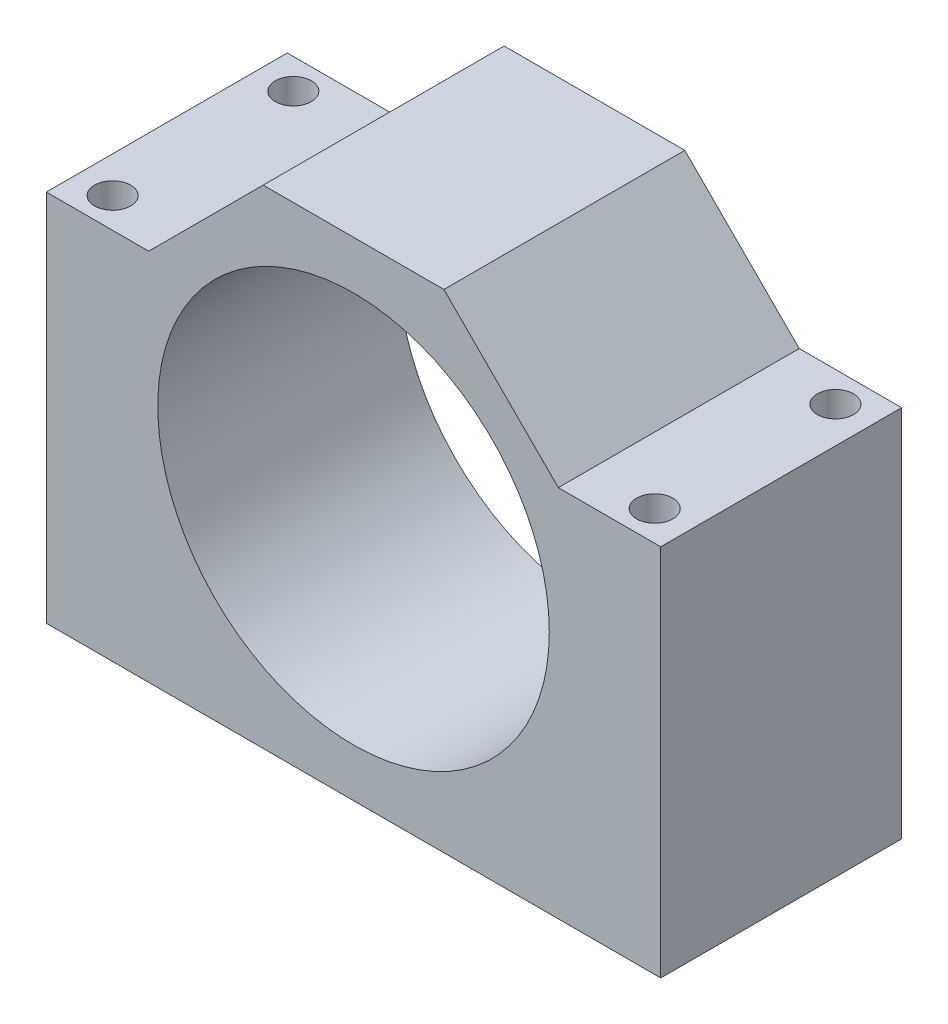
ISO-10303-21;
HEADER;
FILE_DESCRIPTION(('STEP AP214'),'2;1');
FILE_NAME('part.step','',(''),(''),'','','');
FILE_SCHEMA(('AUTOMOTIVE_DESIGN { 1 0 10303 214 1 1 1 1 }'));
ENDSEC;
DATA;
#1=APPLICATION_CONTEXT('core data for automotive mechanical design processes');
#2=APPLICATION_PROTOCOL_DEFINITION('international standard','automotive_design',2000,#1);
#3=PRODUCT_CONTEXT('',#1,'mechanical');
#4=PRODUCT('Part','Part','',(#3));
#5=PRODUCT_RELATED_PRODUCT_CATEGORY('part','',(#4));
#6=PRODUCT_DEFINITION_FORMATION('','',#4);
#7=PRODUCT_DEFINITION_CONTEXT('part definition',#1,'design');
#8=PRODUCT_DEFINITION('design','',#6,#7);
#9=PRODUCT_DEFINITION_SHAPE('','',#8);
#10=(LENGTH_UNIT() NAMED_UNIT(*) SI_UNIT(.MILLI.,.METRE.));
#11=(NAMED_UNIT(*) PLANE_ANGLE_UNIT() SI_UNIT($,.RADIAN.));
#12=(NAMED_UNIT(*) SI_UNIT($,.STERADIAN.) SOLID_ANGLE_UNIT());
#13=UNCERTAINTY_MEASURE_WITH_UNIT(LENGTH_MEASURE(1.E-05),#10,'distance_accuracy_value','');
#14=(GEOMETRIC_REPRESENTATION_CONTEXT(3) GLOBAL_UNCERTAINTY_ASSIGNED_CONTEXT((#13)) GLOBAL_UNIT_ASSIGNED_CONTEXT((#10,
#11,#12)) REPRESENTATION_CONTEXT('',''));
#15=CARTESIAN_POINT('',(0.,0.,0.));
#16=DIRECTION('',(0.,0.,1.));
#17=DIRECTION('',(1.,0.,0.));
#18=AXIS2_PLACEMENT_3D('',#15,#16,#17);
#19=CARTESIAN_POINT('',(0.,0.,40.));
#20=DIRECTION('',(0.,0.,-1.));
#21=DIRECTION('',(-1.,0.,0.));
#22=AXIS2_PLACEMENT_3D('',#19,#20,#21);
#23=PLANE('',#22);
#24=DIRECTION('',(0.,-1.,0.));
#25=VECTOR('',#24,1.);
#26=CARTESIAN_POINT('',(0.,0.,40.));
#27=LINE('',#26,#25);
#28=CARTESIAN_POINT('',(0.,62.,40.));
#29=VERTEX_POINT('',#28);
#30=CARTESIAN_POINT('',(0.,0.,40.));
#31=VERTEX_POINT('',#30);
#32=EDGE_CURVE('E164',#29,#31,#27,.T.);
#33=ORIENTED_EDGE('',*,*,#32,.T.);
#34=DIRECTION('',(1.,0.,0.));
#35=VECTOR('',#34,1.);
#36=CARTESIAN_POINT('',(0.,0.,40.));
#37=LINE('',#36,#35);
#38=CARTESIAN_POINT('',(102.,0.,40.));
#39=VERTEX_POINT('',#38);
#40=EDGE_CURVE('E100',#31,#39,#37,.T.);
#41=ORIENTED_EDGE('',*,*,#40,.T.);
#42=DIRECTION('',(0.,1.,0.));
#43=VECTOR('',#42,1.);
#44=CARTESIAN_POINT('',(102.,0.,40.));
#45=LINE('',#44,#43);
#46=CARTESIAN_POINT('',(102.,62.,40.));
#47=VERTEX_POINT('',#46);
#48=EDGE_CURVE('E185',#39,#47,#45,.T.);
#49=ORIENTED_EDGE('',*,*,#48,.T.);
#50=DIRECTION('',(-1.,0.,0.));
#51=VECTOR('',#50,1.);
#52=CARTESIAN_POINT('',(102.,62.,40.));
#53=LINE('',#52,#51);
#54=CARTESIAN_POINT('',(85.,62.,40.));
#55=VERTEX_POINT('',#54);
#56=EDGE_CURVE('E199',#47,#55,#53,.T.);
#57=ORIENTED_EDGE('',*,*,#56,.T.);
#58=DIRECTION('',(-0.707106781186547,0.707106781186548,0.));
#59=VECTOR('',#58,1.);
#60=CARTESIAN_POINT('',(85.,62.,40.));
#61=LINE('',#60,#59);
#62=CARTESIAN_POINT('',(66.,81.,40.));
#63=VERTEX_POINT('',#62);
#64=EDGE_CURVE('E119',#55,#63,#61,.T.);
#65=ORIENTED_EDGE('',*,*,#64,.T.);
#66=DIRECTION('',(-1.,0.,0.));
#67=VECTOR('',#66,1.);
#68=CARTESIAN_POINT('',(36.,81.,40.));
#69=LINE('',#68,#67);
#70=CARTESIAN_POINT('',(36.,81.,40.));
#71=VERTEX_POINT('',#70);
#72=EDGE_CURVE('E113',#63,#71,#69,.T.);
#73=ORIENTED_EDGE('',*,*,#72,.T.);
#74=DIRECTION('',(-0.707106781186547,-0.707106781186548,0.));
#75=VECTOR('',#74,1.);
#76=CARTESIAN_POINT('',(17.,62.,40.));
#77=LINE('',#76,#75);
#78=CARTESIAN_POINT('',(17.,62.,40.));
#79=VERTEX_POINT('',#78);
#80=EDGE_CURVE('E117',#71,#79,#77,.T.);
#81=ORIENTED_EDGE('',*,*,#80,.T.);
#82=DIRECTION('',(-1.,0.,0.));
#83=VECTOR('',#82,1.);
#84=CARTESIAN_POINT('',(0.,62.,40.));
#85=LINE('',#84,#83);
#86=EDGE_CURVE('E57',#79,#29,#85,.T.);
#87=ORIENTED_EDGE('',*,*,#86,.T.);
#88=EDGE_LOOP('',(#33,#41,#49,#57,#65,#73,#81,#87));
#89=FACE_BOUND('',#88,.T.);
#90=CARTESIAN_POINT('',(51.,40.5,40.));
#91=DIRECTION('',(0.,0.,1.));
#92=DIRECTION('',(1.,0.,0.));
#93=AXIS2_PLACEMENT_3D('',#90,#91,#92);
#94=CIRCLE('',#93,32.5);
#95=CARTESIAN_POINT('',(83.5,40.5,40.));
#96=VERTEX_POINT('',#95);
#97=EDGE_CURVE('E146',#96,#96,#94,.T.);
#98=ORIENTED_EDGE('',*,*,#97,.F.);
#99=EDGE_LOOP('',(#98));
#100=FACE_BOUND('',#99,.T.);
#101=ADVANCED_FACE('F39',(#89,#100),#23,.F.);
#102=CARTESIAN_POINT('',(0.,0.,0.));
#103=DIRECTION('',(0.,0.,-1.));
#104=DIRECTION('',(-1.,0.,0.));
#105=AXIS2_PLACEMENT_3D('',#102,#103,#104);
#106=PLANE('',#105);
#107=DIRECTION('',(0.,-1.,0.));
#108=VECTOR('',#107,1.);
#109=CARTESIAN_POINT('',(0.,0.,0.));
#110=LINE('',#109,#108);
#111=CARTESIAN_POINT('',(0.,62.,0.));
#112=VERTEX_POINT('',#111);
#113=CARTESIAN_POINT('',(0.,0.,0.));
#114=VERTEX_POINT('',#113);
#115=EDGE_CURVE('E141',#112,#114,#110,.T.);
#116=ORIENTED_EDGE('',*,*,#115,.F.);
#117=DIRECTION('',(-1.,0.,0.));
#118=VECTOR('',#117,1.);
#119=CARTESIAN_POINT('',(0.,62.,0.));
#120=LINE('',#119,#118);
#121=CARTESIAN_POINT('',(17.,62.,0.));
#122=VERTEX_POINT('',#121);
#123=EDGE_CURVE('E92',#122,#112,#120,.T.);
#124=ORIENTED_EDGE('',*,*,#123,.F.);
#125=DIRECTION('',(-0.707106781186547,-0.707106781186548,0.));
#126=VECTOR('',#125,1.);
#127=CARTESIAN_POINT('',(17.,62.,0.));
#128=LINE('',#127,#126);
#129=CARTESIAN_POINT('',(36.,81.,0.));
#130=VERTEX_POINT('',#129);
#131=EDGE_CURVE('E86',#130,#122,#128,.T.);
#132=ORIENTED_EDGE('',*,*,#131,.F.);
#133=DIRECTION('',(-1.,0.,0.));
#134=VECTOR('',#133,1.);
#135=CARTESIAN_POINT('',(36.,81.,0.));
#136=LINE('',#135,#134);
#137=CARTESIAN_POINT('',(66.,81.,0.));
#138=VERTEX_POINT('',#137);
#139=EDGE_CURVE('E128',#138,#130,#136,.T.);
#140=ORIENTED_EDGE('',*,*,#139,.F.);
#141=DIRECTION('',(-0.707106781186547,0.707106781186548,0.));
#142=VECTOR('',#141,1.);
#143=CARTESIAN_POINT('',(85.,62.,0.));
#144=LINE('',#143,#142);
#145=CARTESIAN_POINT('',(85.,62.,0.));
#146=VERTEX_POINT('',#145);
#147=EDGE_CURVE('E155',#146,#138,#144,.T.);
#148=ORIENTED_EDGE('',*,*,#147,.F.);
#149=DIRECTION('',(-1.,0.,0.));
#150=VECTOR('',#149,1.);
#151=CARTESIAN_POINT('',(102.,62.,0.));
#152=LINE('',#151,#150);
#153=CARTESIAN_POINT('',(102.,62.,0.));
#154=VERTEX_POINT('',#153);
#155=EDGE_CURVE('E152',#154,#146,#152,.T.);
#156=ORIENTED_EDGE('',*,*,#155,.F.);
#157=DIRECTION('',(0.,1.,0.));
#158=VECTOR('',#157,1.);
#159=CARTESIAN_POINT('',(102.,0.,0.));
#160=LINE('',#159,#158);
#161=CARTESIAN_POINT('',(102.,0.,0.));
#162=VERTEX_POINT('',#161);
#163=EDGE_CURVE('E149',#162,#154,#160,.T.);
#164=ORIENTED_EDGE('',*,*,#163,.F.);
#165=DIRECTION('',(1.,0.,0.));
#166=VECTOR('',#165,1.);
#167=CARTESIAN_POINT('',(0.,0.,0.));
#168=LINE('',#167,#166);
#169=EDGE_CURVE('E145',#114,#162,#168,.T.);
#170=ORIENTED_EDGE('',*,*,#169,.F.);
#171=EDGE_LOOP('',(#116,#124,#132,#140,#148,#156,#164,#170));
#172=FACE_BOUND('',#171,.T.);
#173=CARTESIAN_POINT('',(51.,40.5,0.));
#174=DIRECTION('',(0.,0.,1.));
#175=DIRECTION('',(1.,0.,0.));
#176=AXIS2_PLACEMENT_3D('',#173,#174,#175);
#177=CIRCLE('',#176,32.5);
#178=CARTESIAN_POINT('',(83.5,40.5,0.));
#179=VERTEX_POINT('',#178);
#180=EDGE_CURVE('E209',#179,#179,#177,.T.);
#181=ORIENTED_EDGE('',*,*,#180,.T.);
#182=EDGE_LOOP('',(#181));
#183=FACE_BOUND('',#182,.T.);
#184=ADVANCED_FACE('F189',(#172,#183),#106,.T.);
#185=CARTESIAN_POINT('',(0.,0.,40.));
#186=DIRECTION('',(1.,0.,0.));
#187=DIRECTION('',(0.,0.,-1.));
#188=AXIS2_PLACEMENT_3D('',#185,#186,#187);
#189=PLANE('',#188);
#190=ORIENTED_EDGE('',*,*,#115,.T.);
#191=DIRECTION('',(0.,0.,-1.));
#192=VECTOR('',#191,1.);
#193=CARTESIAN_POINT('',(0.,0.,40.));
#194=LINE('',#193,#192);
#195=EDGE_CURVE('E11',#31,#114,#194,.T.);
#196=ORIENTED_EDGE('',*,*,#195,.F.);
#197=ORIENTED_EDGE('',*,*,#32,.F.);
#198=DIRECTION('',(0.,0.,-1.));
#199=VECTOR('',#198,1.);
#200=CARTESIAN_POINT('',(0.,62.,40.));
#201=LINE('',#200,#199);
#202=EDGE_CURVE('E137',#29,#112,#201,.T.);
#203=ORIENTED_EDGE('',*,*,#202,.T.);
#204=EDGE_LOOP('',(#190,#196,#197,#203));
#205=FACE_BOUND('',#204,.T.);
#206=ADVANCED_FACE('F41',(#205),#189,.F.);
#207=CARTESIAN_POINT('',(0.,0.,40.));
#208=DIRECTION('',(0.,1.,0.));
#209=DIRECTION('',(-1.,0.,0.));
#210=AXIS2_PLACEMENT_3D('',#207,#208,#209);
#211=PLANE('',#210);
#212=CARTESIAN_POINT('',(5.99999999999998,0.,35.));
#213=DIRECTION('',(0.,1.,0.));
#214=DIRECTION('',(0.,0.,1.));
#215=AXIS2_PLACEMENT_3D('',#212,#213,#214);
#216=CIRCLE('',#215,3.);
#217=CARTESIAN_POINT('',(5.99999999999998,0.,38.));
#218=VERTEX_POINT('',#217);
#219=EDGE_CURVE('E221',#218,#218,#216,.T.);
#220=ORIENTED_EDGE('',*,*,#219,.T.);
#221=EDGE_LOOP('',(#220));
#222=FACE_BOUND('',#221,.T.);
#223=CARTESIAN_POINT('',(96.,0.,4.99999999999999));
#224=DIRECTION('',(0.,1.,0.));
#225=DIRECTION('',(0.,0.,1.));
#226=AXIS2_PLACEMENT_3D('',#223,#224,#225);
#227=CIRCLE('',#226,3.00000000000001);
#228=CARTESIAN_POINT('',(96.,0.,8.));
#229=VERTEX_POINT('',#228);
#230=EDGE_CURVE('E229',#229,#229,#227,.T.);
#231=ORIENTED_EDGE('',*,*,#230,.T.);
#232=EDGE_LOOP('',(#231));
#233=FACE_BOUND('',#232,.T.);
#234=CARTESIAN_POINT('',(96.,0.,35.));
#235=DIRECTION('',(0.,1.,0.));
#236=DIRECTION('',(0.,0.,1.));
#237=AXIS2_PLACEMENT_3D('',#234,#235,#236);
#238=CIRCLE('',#237,3.00000000000001);
#239=CARTESIAN_POINT('',(96.,0.,38.));
#240=VERTEX_POINT('',#239);
#241=EDGE_CURVE('E230',#240,#240,#238,.T.);
#242=ORIENTED_EDGE('',*,*,#241,.T.);
#243=EDGE_LOOP('',(#242));
#244=FACE_BOUND('',#243,.T.);
#245=CARTESIAN_POINT('',(5.99999999999998,0.,5.));
#246=DIRECTION('',(0.,1.,0.));
#247=DIRECTION('',(0.,0.,1.));
#248=AXIS2_PLACEMENT_3D('',#245,#246,#247);
#249=CIRCLE('',#248,3.);
#250=CARTESIAN_POINT('',(5.99999999999998,0.,8.00000000000001));
#251=VERTEX_POINT('',#250);
#252=EDGE_CURVE('E213',#251,#251,#249,.T.);
#253=ORIENTED_EDGE('',*,*,#252,.T.);
#254=EDGE_LOOP('',(#253));
#255=FACE_BOUND('',#254,.T.);
#256=ORIENTED_EDGE('',*,*,#169,.T.);
#257=DIRECTION('',(0.,0.,-1.));
#258=VECTOR('',#257,1.);
#259=CARTESIAN_POINT('',(102.,0.,40.));
#260=LINE('',#259,#258);
#261=EDGE_CURVE('E49',#39,#162,#260,.T.);
#262=ORIENTED_EDGE('',*,*,#261,.F.);
#263=ORIENTED_EDGE('',*,*,#40,.F.);
#264=ORIENTED_EDGE('',*,*,#195,.T.);
#265=EDGE_LOOP('',(#256,#262,#263,#264));
#266=FACE_BOUND('',#265,.T.);
#267=ADVANCED_FACE('F249',(#222,#233,#244,#255,#266),#211,.F.);
#268=CARTESIAN_POINT('',(102.,0.,40.));
#269=DIRECTION('',(-1.,0.,0.));
#270=DIRECTION('',(0.,-1.,0.));
#271=AXIS2_PLACEMENT_3D('',#268,#269,#270);
#272=PLANE('',#271);
#273=ORIENTED_EDGE('',*,*,#163,.T.);
#274=DIRECTION('',(0.,0.,-1.));
#275=VECTOR('',#274,1.);
#276=CARTESIAN_POINT('',(102.,62.,40.));
#277=LINE('',#276,#275);
#278=EDGE_CURVE('E175',#47,#154,#277,.T.);
#279=ORIENTED_EDGE('',*,*,#278,.F.);
#280=ORIENTED_EDGE('',*,*,#48,.F.);
#281=ORIENTED_EDGE('',*,*,#261,.T.);
#282=EDGE_LOOP('',(#273,#279,#280,#281));
#283=FACE_BOUND('',#282,.T.);
#284=ADVANCED_FACE('F183',(#283),#272,.F.);
#285=CARTESIAN_POINT('',(102.,62.,40.));
#286=DIRECTION('',(0.,-1.,0.));
#287=DIRECTION('',(0.,0.,-1.));
#288=AXIS2_PLACEMENT_3D('',#285,#286,#287);
#289=PLANE('',#288);
#290=CARTESIAN_POINT('',(96.,62.,4.99999999999999));
#291=DIRECTION('',(0.,1.,0.));
#292=DIRECTION('',(0.,0.,1.));
#293=AXIS2_PLACEMENT_3D('',#290,#291,#292);
#294=CIRCLE('',#293,3.00000000000001);
#295=CARTESIAN_POINT('',(96.,62.,8.));
#296=VERTEX_POINT('',#295);
#297=EDGE_CURVE('E225',#296,#296,#294,.T.);
#298=ORIENTED_EDGE('',*,*,#297,.F.);
#299=EDGE_LOOP('',(#298));
#300=FACE_BOUND('',#299,.T.);
#301=CARTESIAN_POINT('',(96.,62.,35.));
#302=DIRECTION('',(0.,1.,0.));
#303=DIRECTION('',(0.,0.,1.));
#304=AXIS2_PLACEMENT_3D('',#301,#302,#303);
#305=CIRCLE('',#304,3.00000000000001);
#306=CARTESIAN_POINT('',(96.,62.,38.));
#307=VERTEX_POINT('',#306);
#308=EDGE_CURVE('E241',#307,#307,#305,.T.);
#309=ORIENTED_EDGE('',*,*,#308,.F.);
#310=EDGE_LOOP('',(#309));
#311=FACE_BOUND('',#310,.T.);
#312=ORIENTED_EDGE('',*,*,#155,.T.);
#313=DIRECTION('',(0.,0.,-1.));
#314=VECTOR('',#313,1.);
#315=CARTESIAN_POINT('',(85.,62.,40.));
#316=LINE('',#315,#314);
#317=EDGE_CURVE('E171',#55,#146,#316,.T.);
#318=ORIENTED_EDGE('',*,*,#317,.F.);
#319=ORIENTED_EDGE('',*,*,#56,.F.);
#320=ORIENTED_EDGE('',*,*,#278,.T.);
#321=EDGE_LOOP('',(#312,#318,#319,#320));
#322=FACE_BOUND('',#321,.T.);
#323=ADVANCED_FACE('F194',(#300,#311,#322),#289,.F.);
#324=CARTESIAN_POINT('',(85.,62.,40.));
#325=DIRECTION('',(-0.707106781186548,-0.707106781186547,0.));
#326=DIRECTION('',(0.707106781186547,-0.707106781186548,0.));
#327=AXIS2_PLACEMENT_3D('',#324,#325,#326);
#328=PLANE('',#327);
#329=ORIENTED_EDGE('',*,*,#147,.T.);
#330=DIRECTION('',(0.,0.,-1.));
#331=VECTOR('',#330,1.);
#332=CARTESIAN_POINT('',(66.,81.,40.));
#333=LINE('',#332,#331);
#334=EDGE_CURVE('E130',#63,#138,#333,.T.);
#335=ORIENTED_EDGE('',*,*,#334,.F.);
#336=ORIENTED_EDGE('',*,*,#64,.F.);
#337=ORIENTED_EDGE('',*,*,#317,.T.);
#338=EDGE_LOOP('',(#329,#335,#336,#337));
#339=FACE_BOUND('',#338,.T.);
#340=ADVANCED_FACE('F197',(#339),#328,.F.);
#341=CARTESIAN_POINT('',(36.,81.,40.));
#342=DIRECTION('',(0.,-1.,0.));
#343=DIRECTION('',(0.,0.,-1.));
#344=AXIS2_PLACEMENT_3D('',#341,#342,#343);
#345=PLANE('',#344);
#346=ORIENTED_EDGE('',*,*,#139,.T.);
#347=DIRECTION('',(0.,0.,-1.));
#348=VECTOR('',#347,1.);
#349=CARTESIAN_POINT('',(36.,81.,40.));
#350=LINE('',#349,#348);
#351=EDGE_CURVE('E125',#71,#130,#350,.T.);
#352=ORIENTED_EDGE('',*,*,#351,.F.);
#353=ORIENTED_EDGE('',*,*,#72,.F.);
#354=ORIENTED_EDGE('',*,*,#334,.T.);
#355=EDGE_LOOP('',(#346,#352,#353,#354));
#356=FACE_BOUND('',#355,.T.);
#357=ADVANCED_FACE('F126',(#356),#345,.F.);
#358=CARTESIAN_POINT('',(17.,62.,40.));
#359=DIRECTION('',(0.707106781186548,-0.707106781186547,0.));
#360=DIRECTION('',(0.707106781186547,0.707106781186548,0.));
#361=AXIS2_PLACEMENT_3D('',#358,#359,#360);
#362=PLANE('',#361);
#363=ORIENTED_EDGE('',*,*,#131,.T.);
#364=DIRECTION('',(0.,0.,-1.));
#365=VECTOR('',#364,1.);
#366=CARTESIAN_POINT('',(17.,62.,40.));
#367=LINE('',#366,#365);
#368=EDGE_CURVE('E131',#79,#122,#367,.T.);
#369=ORIENTED_EDGE('',*,*,#368,.F.);
#370=ORIENTED_EDGE('',*,*,#80,.F.);
#371=ORIENTED_EDGE('',*,*,#351,.T.);
#372=EDGE_LOOP('',(#363,#369,#370,#371));
#373=FACE_BOUND('',#372,.T.);
#374=ADVANCED_FACE('F133',(#373),#362,.F.);
#375=CARTESIAN_POINT('',(0.,62.,40.));
#376=DIRECTION('',(0.,-1.,0.));
#377=DIRECTION('',(0.,0.,-1.));
#378=AXIS2_PLACEMENT_3D('',#375,#376,#377);
#379=PLANE('',#378);
#380=CARTESIAN_POINT('',(5.99999999999998,62.,35.));
#381=DIRECTION('',(0.,1.,0.));
#382=DIRECTION('',(0.,0.,1.));
#383=AXIS2_PLACEMENT_3D('',#380,#381,#382);
#384=CIRCLE('',#383,3.);
#385=CARTESIAN_POINT('',(5.99999999999998,62.,38.));
#386=VERTEX_POINT('',#385);
#387=EDGE_CURVE('E234',#386,#386,#384,.T.);
#388=ORIENTED_EDGE('',*,*,#387,.F.);
#389=EDGE_LOOP('',(#388));
#390=FACE_BOUND('',#389,.T.);
#391=CARTESIAN_POINT('',(5.99999999999998,62.,5.));
#392=DIRECTION('',(0.,1.,0.));
#393=DIRECTION('',(0.,0.,1.));
#394=AXIS2_PLACEMENT_3D('',#391,#392,#393);
#395=CIRCLE('',#394,3.);
#396=CARTESIAN_POINT('',(5.99999999999998,62.,8.00000000000001));
#397=VERTEX_POINT('',#396);
#398=EDGE_CURVE('E217',#397,#397,#395,.T.);
#399=ORIENTED_EDGE('',*,*,#398,.F.);
#400=EDGE_LOOP('',(#399));
#401=FACE_BOUND('',#400,.T.);
#402=ORIENTED_EDGE('',*,*,#123,.T.);
#403=ORIENTED_EDGE('',*,*,#202,.F.);
#404=ORIENTED_EDGE('',*,*,#86,.F.);
#405=ORIENTED_EDGE('',*,*,#368,.T.);
#406=EDGE_LOOP('',(#402,#403,#404,#405));
#407=FACE_BOUND('',#406,.T.);
#408=ADVANCED_FACE('F280',(#390,#401,#407),#379,.F.);
#409=CARTESIAN_POINT('',(51.,40.5,40.));
#410=DIRECTION('',(0.,0.,-1.));
#411=DIRECTION('',(-1.,0.,0.));
#412=AXIS2_PLACEMENT_3D('',#409,#410,#411);
#413=CYLINDRICAL_SURFACE('',#412,32.5);
#414=ORIENTED_EDGE('',*,*,#97,.T.);
#415=EDGE_LOOP('',(#414));
#416=FACE_BOUND('',#415,.T.);
#417=ORIENTED_EDGE('',*,*,#180,.F.);
#418=EDGE_LOOP('',(#417));
#419=FACE_BOUND('',#418,.T.);
#420=ADVANCED_FACE('F277',(#416,#419),#413,.F.);
#421=CARTESIAN_POINT('',(5.99999999999998,0.,5.));
#422=DIRECTION('',(0.,1.,0.));
#423=DIRECTION('',(0.,0.,1.));
#424=AXIS2_PLACEMENT_3D('',#421,#422,#423);
#425=CYLINDRICAL_SURFACE('',#424,3.);
#426=ORIENTED_EDGE('',*,*,#252,.F.);
#427=EDGE_LOOP('',(#426));
#428=FACE_BOUND('',#427,.T.);
#429=ORIENTED_EDGE('',*,*,#398,.T.);
#430=EDGE_LOOP('',(#429));
#431=FACE_BOUND('',#430,.T.);
#432=ADVANCED_FACE('F306',(#428,#431),#425,.F.);
#433=CARTESIAN_POINT('',(5.99999999999998,0.,35.));
#434=DIRECTION('',(0.,1.,0.));
#435=DIRECTION('',(0.,0.,1.));
#436=AXIS2_PLACEMENT_3D('',#433,#434,#435);
#437=CYLINDRICAL_SURFACE('',#436,3.);
#438=ORIENTED_EDGE('',*,*,#219,.F.);
#439=EDGE_LOOP('',(#438));
#440=FACE_BOUND('',#439,.T.);
#441=ORIENTED_EDGE('',*,*,#387,.T.);
#442=EDGE_LOOP('',(#441));
#443=FACE_BOUND('',#442,.T.);
#444=ADVANCED_FACE('F256',(#440,#443),#437,.F.);
#445=CARTESIAN_POINT('',(96.,0.,35.));
#446=DIRECTION('',(0.,1.,0.));
#447=DIRECTION('',(0.,0.,1.));
#448=AXIS2_PLACEMENT_3D('',#445,#446,#447);
#449=CYLINDRICAL_SURFACE('',#448,3.00000000000001);
#450=ORIENTED_EDGE('',*,*,#241,.F.);
#451=EDGE_LOOP('',(#450));
#452=FACE_BOUND('',#451,.T.);
#453=ORIENTED_EDGE('',*,*,#308,.T.);
#454=EDGE_LOOP('',(#453));
#455=FACE_BOUND('',#454,.T.);
#456=ADVANCED_FACE('F252',(#452,#455),#449,.F.);
#457=CARTESIAN_POINT('',(96.,0.,4.99999999999999));
#458=DIRECTION('',(0.,1.,0.));
#459=DIRECTION('',(0.,0.,1.));
#460=AXIS2_PLACEMENT_3D('',#457,#458,#459);
#461=CYLINDRICAL_SURFACE('',#460,3.00000000000001);
#462=ORIENTED_EDGE('',*,*,#230,.F.);
#463=EDGE_LOOP('',(#462));
#464=FACE_BOUND('',#463,.T.);
#465=ORIENTED_EDGE('',*,*,#297,.T.);
#466=EDGE_LOOP('',(#465));
#467=FACE_BOUND('',#466,.T.);
#468=ADVANCED_FACE('F255',(#464,#467),#461,.F.);
#469=CLOSED_SHELL('',(#101,#184,#206,#267,#284,#323,#340,#357,#374,#408,#420,#432,#444,#456,#468));
#470=MANIFOLD_SOLID_BREP('B2',#469);
#471=ADVANCED_BREP_SHAPE_REPRESENTATION('',(#18,#470),#14);
#472=SHAPE_DEFINITION_REPRESENTATION(#9,#471);
ENDSEC;
END-ISO-10303-21;
